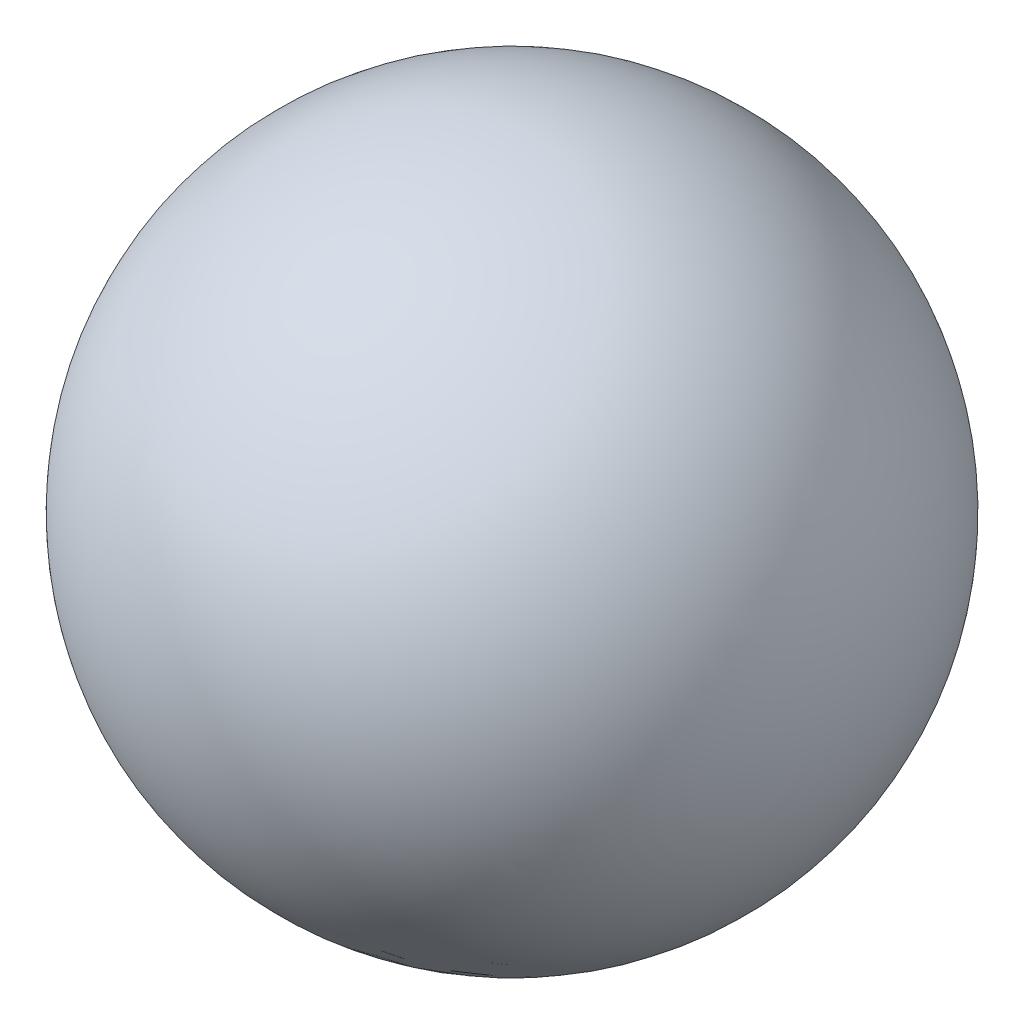
ISO-10303-21;
HEADER;
FILE_DESCRIPTION(('STEP AP214'),'2;1');
FILE_NAME('part.step','',(''),(''),'','','');
FILE_SCHEMA(('AUTOMOTIVE_DESIGN { 1 0 10303 214 1 1 1 1 }'));
ENDSEC;
DATA;
#1=APPLICATION_CONTEXT('core data for automotive mechanical design processes');
#2=APPLICATION_PROTOCOL_DEFINITION('international standard','automotive_design',2000,#1);
#3=PRODUCT_CONTEXT('',#1,'mechanical');
#4=PRODUCT('Part','Part','',(#3));
#5=PRODUCT_RELATED_PRODUCT_CATEGORY('part','',(#4));
#6=PRODUCT_DEFINITION_FORMATION('','',#4);
#7=PRODUCT_DEFINITION_CONTEXT('part definition',#1,'design');
#8=PRODUCT_DEFINITION('design','',#6,#7);
#9=PRODUCT_DEFINITION_SHAPE('','',#8);
#10=(LENGTH_UNIT() NAMED_UNIT(*) SI_UNIT(.MILLI.,.METRE.));
#11=(NAMED_UNIT(*) PLANE_ANGLE_UNIT() SI_UNIT($,.RADIAN.));
#12=(NAMED_UNIT(*) SI_UNIT($,.STERADIAN.) SOLID_ANGLE_UNIT());
#13=UNCERTAINTY_MEASURE_WITH_UNIT(LENGTH_MEASURE(1.E-05),#10,'distance_accuracy_value','');
#14=(GEOMETRIC_REPRESENTATION_CONTEXT(3) GLOBAL_UNCERTAINTY_ASSIGNED_CONTEXT((#13)) GLOBAL_UNIT_ASSIGNED_CONTEXT((#10,
#11,#12)) REPRESENTATION_CONTEXT('',''));
#15=CARTESIAN_POINT('',(0.,0.,0.));
#16=DIRECTION('',(0.,0.,1.));
#17=DIRECTION('',(1.,0.,0.));
#18=AXIS2_PLACEMENT_3D('',#15,#16,#17);
#19=CARTESIAN_POINT('',(0.,0.,0.));
#20=DIRECTION('',(0.778706306918697,0.568490357066084,0.265396310237953));
#21=DIRECTION('',(0.335295180434123,-0.734634797937426,0.589821036957047));
#22=AXIS2_PLACEMENT_3D('',#19,#20,#21);
#23=SPHERICAL_SURFACE('',#22,0.794);
#24=CARTESIAN_POINT('',(-0.618292807693446,-0.451381343510471,-0.210724670328935));
#25=VERTEX_POINT('',#24);
#26=VERTEX_LOOP('',#25);
#27=FACE_BOUND('',#26,.T.);
#28=CARTESIAN_POINT('',(0.618292807693446,0.451381343510471,0.210724670328935));
#29=VERTEX_POINT('',#28);
#30=VERTEX_LOOP('',#29);
#31=FACE_BOUND('',#30,.T.);
#32=ADVANCED_FACE('F15',(#27,#31),#23,.T.);
#33=CLOSED_SHELL('',(#32));
#34=MANIFOLD_SOLID_BREP('B1',#33);
#35=ADVANCED_BREP_SHAPE_REPRESENTATION('',(#18,#34),#14);
#36=SHAPE_DEFINITION_REPRESENTATION(#9,#35);
ENDSEC;
END-ISO-10303-21;
